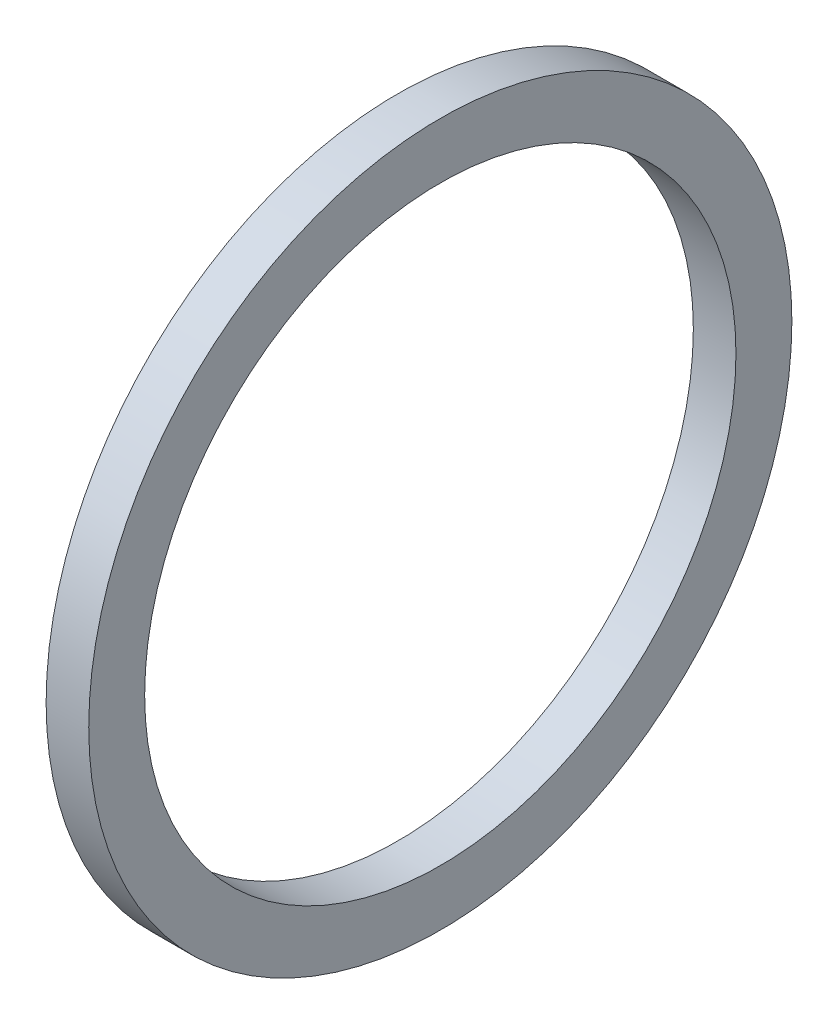
ISO-10303-21;
HEADER;
FILE_DESCRIPTION(('STEP AP214'),'2;1');
FILE_NAME('part.step','',(''),(''),'','','');
FILE_SCHEMA(('AUTOMOTIVE_DESIGN { 1 0 10303 214 1 1 1 1 }'));
ENDSEC;
DATA;
#1=APPLICATION_CONTEXT('core data for automotive mechanical design processes');
#2=APPLICATION_PROTOCOL_DEFINITION('international standard','automotive_design',2000,#1);
#3=PRODUCT_CONTEXT('',#1,'mechanical');
#4=PRODUCT('Part','Part','',(#3));
#5=PRODUCT_RELATED_PRODUCT_CATEGORY('part','',(#4));
#6=PRODUCT_DEFINITION_FORMATION('','',#4);
#7=PRODUCT_DEFINITION_CONTEXT('part definition',#1,'design');
#8=PRODUCT_DEFINITION('design','',#6,#7);
#9=PRODUCT_DEFINITION_SHAPE('','',#8);
#10=(LENGTH_UNIT() NAMED_UNIT(*) SI_UNIT(.MILLI.,.METRE.));
#11=(NAMED_UNIT(*) PLANE_ANGLE_UNIT() SI_UNIT($,.RADIAN.));
#12=(NAMED_UNIT(*) SI_UNIT($,.STERADIAN.) SOLID_ANGLE_UNIT());
#13=UNCERTAINTY_MEASURE_WITH_UNIT(LENGTH_MEASURE(1.E-05),#10,'distance_accuracy_value','');
#14=(GEOMETRIC_REPRESENTATION_CONTEXT(3) GLOBAL_UNCERTAINTY_ASSIGNED_CONTEXT((#13)) GLOBAL_UNIT_ASSIGNED_CONTEXT((#10,
#11,#12)) REPRESENTATION_CONTEXT('',''));
#15=CARTESIAN_POINT('',(0.,0.,0.));
#16=DIRECTION('',(0.,0.,1.));
#17=DIRECTION('',(1.,0.,0.));
#18=AXIS2_PLACEMENT_3D('',#15,#16,#17);
#19=CARTESIAN_POINT('',(0.,-14.097,0.));
#20=DIRECTION('',(-1.,0.,0.));
#21=DIRECTION('',(0.,0.,1.));
#22=AXIS2_PLACEMENT_3D('',#19,#20,#21);
#23=PLANE('',#22);
#24=CARTESIAN_POINT('',(0.,0.,0.));
#25=DIRECTION('',(-1.,0.,0.));
#26=DIRECTION('',(0.,0.,1.));
#27=AXIS2_PLACEMENT_3D('',#24,#25,#26);
#28=CIRCLE('',#27,16.764);
#29=CARTESIAN_POINT('',(0.,0.,16.764));
#30=VERTEX_POINT('',#29);
#31=EDGE_CURVE('E10',#30,#30,#28,.T.);
#32=ORIENTED_EDGE('',*,*,#31,.T.);
#33=EDGE_LOOP('',(#32));
#34=FACE_BOUND('',#33,.T.);
#35=CARTESIAN_POINT('',(0.,0.,0.));
#36=DIRECTION('',(-1.,0.,0.));
#37=DIRECTION('',(0.,0.,1.));
#38=AXIS2_PLACEMENT_3D('',#35,#36,#37);
#39=CIRCLE('',#38,14.097);
#40=CARTESIAN_POINT('',(0.,0.,14.097));
#41=VERTEX_POINT('',#40);
#42=EDGE_CURVE('E43',#41,#41,#39,.T.);
#43=ORIENTED_EDGE('',*,*,#42,.F.);
#44=EDGE_LOOP('',(#43));
#45=FACE_BOUND('',#44,.T.);
#46=ADVANCED_FACE('F29',(#34,#45),#23,.T.);
#47=CARTESIAN_POINT('',(-43.7165807560137,0.,0.));
#48=DIRECTION('',(-1.,0.,0.));
#49=DIRECTION('',(0.,0.,1.));
#50=AXIS2_PLACEMENT_3D('',#47,#48,#49);
#51=CYLINDRICAL_SURFACE('',#50,16.764);
#52=CARTESIAN_POINT('',(2.032,0.,0.));
#53=DIRECTION('',(-1.,0.,0.));
#54=DIRECTION('',(0.,0.,1.));
#55=AXIS2_PLACEMENT_3D('',#52,#53,#54);
#56=CIRCLE('',#55,16.764);
#57=CARTESIAN_POINT('',(2.032,0.,16.764));
#58=VERTEX_POINT('',#57);
#59=EDGE_CURVE('E35',#58,#58,#56,.T.);
#60=ORIENTED_EDGE('',*,*,#59,.T.);
#61=EDGE_LOOP('',(#60));
#62=FACE_BOUND('',#61,.T.);
#63=ORIENTED_EDGE('',*,*,#31,.F.);
#64=EDGE_LOOP('',(#63));
#65=FACE_BOUND('',#64,.T.);
#66=ADVANCED_FACE('F53',(#62,#65),#51,.T.);
#67=CARTESIAN_POINT('',(2.032,-14.097,0.));
#68=DIRECTION('',(1.,0.,0.));
#69=DIRECTION('',(0.,0.,-1.));
#70=AXIS2_PLACEMENT_3D('',#67,#68,#69);
#71=PLANE('',#70);
#72=CARTESIAN_POINT('',(2.032,0.,0.));
#73=DIRECTION('',(-1.,0.,0.));
#74=DIRECTION('',(0.,0.,1.));
#75=AXIS2_PLACEMENT_3D('',#72,#73,#74);
#76=CIRCLE('',#75,14.097);
#77=CARTESIAN_POINT('',(2.032,0.,14.097));
#78=VERTEX_POINT('',#77);
#79=EDGE_CURVE('E39',#78,#78,#76,.T.);
#80=ORIENTED_EDGE('',*,*,#79,.T.);
#81=EDGE_LOOP('',(#80));
#82=FACE_BOUND('',#81,.T.);
#83=ORIENTED_EDGE('',*,*,#59,.F.);
#84=EDGE_LOOP('',(#83));
#85=FACE_BOUND('',#84,.T.);
#86=ADVANCED_FACE('F57',(#82,#85),#71,.T.);
#87=CARTESIAN_POINT('',(-43.7165807560137,0.,0.));
#88=DIRECTION('',(-1.,0.,0.));
#89=DIRECTION('',(0.,0.,1.));
#90=AXIS2_PLACEMENT_3D('',#87,#88,#89);
#91=CYLINDRICAL_SURFACE('',#90,14.097);
#92=ORIENTED_EDGE('',*,*,#42,.T.);
#93=EDGE_LOOP('',(#92));
#94=FACE_BOUND('',#93,.T.);
#95=ORIENTED_EDGE('',*,*,#79,.F.);
#96=EDGE_LOOP('',(#95));
#97=FACE_BOUND('',#96,.T.);
#98=ADVANCED_FACE('F49',(#94,#97),#91,.F.);
#99=CLOSED_SHELL('',(#46,#66,#86,#98));
#100=MANIFOLD_SOLID_BREP('B2',#99);
#101=ADVANCED_BREP_SHAPE_REPRESENTATION('',(#18,#100),#14);
#102=SHAPE_DEFINITION_REPRESENTATION(#9,#101);
ENDSEC;
END-ISO-10303-21;
